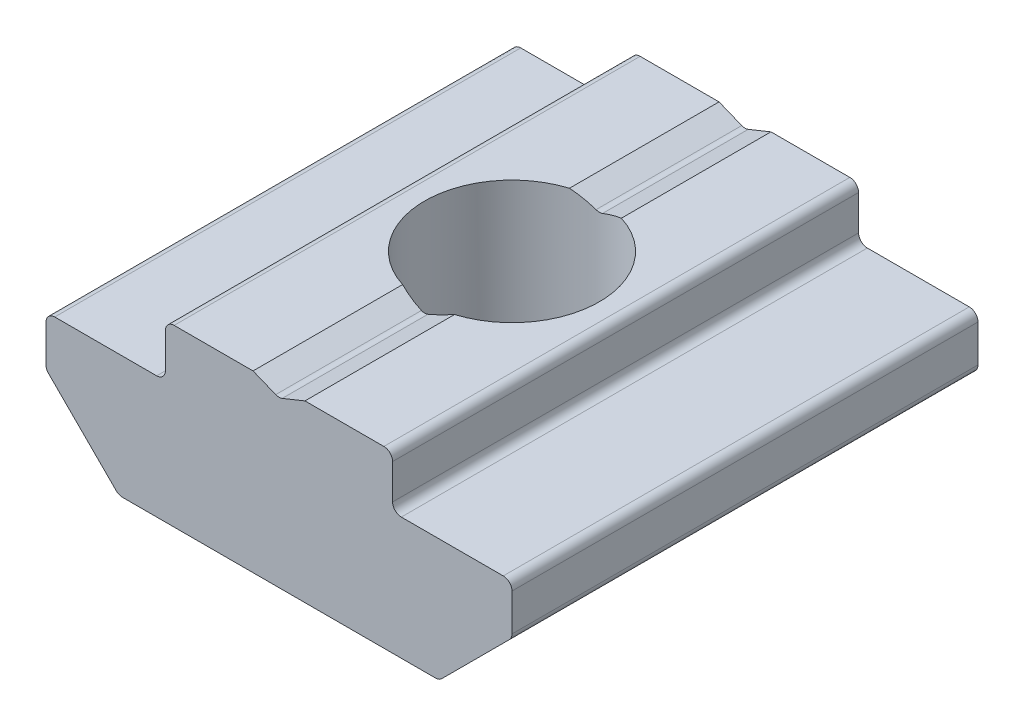
ISO-10303-21;
HEADER;
FILE_DESCRIPTION(('STEP AP214'),'2;1');
FILE_NAME('part.step','',(''),(''),'','','');
FILE_SCHEMA(('AUTOMOTIVE_DESIGN { 1 0 10303 214 1 1 1 1 }'));
ENDSEC;
DATA;
#1=APPLICATION_CONTEXT('core data for automotive mechanical design processes');
#2=APPLICATION_PROTOCOL_DEFINITION('international standard','automotive_design',2000,#1);
#3=PRODUCT_CONTEXT('',#1,'mechanical');
#4=PRODUCT('Part','Part','',(#3));
#5=PRODUCT_RELATED_PRODUCT_CATEGORY('part','',(#4));
#6=PRODUCT_DEFINITION_FORMATION('','',#4);
#7=PRODUCT_DEFINITION_CONTEXT('part definition',#1,'design');
#8=PRODUCT_DEFINITION('design','',#6,#7);
#9=PRODUCT_DEFINITION_SHAPE('','',#8);
#10=(LENGTH_UNIT() NAMED_UNIT(*) SI_UNIT(.MILLI.,.METRE.));
#11=(NAMED_UNIT(*) PLANE_ANGLE_UNIT() SI_UNIT($,.RADIAN.));
#12=(NAMED_UNIT(*) SI_UNIT($,.STERADIAN.) SOLID_ANGLE_UNIT());
#13=UNCERTAINTY_MEASURE_WITH_UNIT(LENGTH_MEASURE(1.E-05),#10,'distance_accuracy_value','');
#14=(GEOMETRIC_REPRESENTATION_CONTEXT(3) GLOBAL_UNCERTAINTY_ASSIGNED_CONTEXT((#13)) GLOBAL_UNIT_ASSIGNED_CONTEXT((#10,
#11,#12)) REPRESENTATION_CONTEXT('',''));
#15=CARTESIAN_POINT('',(0.,0.,0.));
#16=DIRECTION('',(0.,0.,1.));
#17=DIRECTION('',(1.,0.,0.));
#18=AXIS2_PLACEMENT_3D('',#15,#16,#17);
#19=CARTESIAN_POINT('',(0.891031267229868,6.,8.));
#20=DIRECTION('',(0.374606593415911,-0.927183854566788,0.));
#21=DIRECTION('',(0.927183854566788,0.374606593415911,0.));
#22=AXIS2_PLACEMENT_3D('',#19,#20,#21);
#23=PLANE('',#22);
#24=CARTESIAN_POINT('',(0.,5.64,0.));
#25=DIRECTION('',(0.374606593415911,-0.927183854566788,0.));
#26=DIRECTION('',(-0.927183854566788,-0.374606593415911,0.));
#27=AXIS2_PLACEMENT_3D('',#24,#25,#26);
#28=ELLIPSE('',#27,3.23560422803275,3.);
#29=CARTESIAN_POINT('',(0.112381978024774,5.68540526643324,2.9978943095138));
#30=VERTEX_POINT('',#29);
#31=CARTESIAN_POINT('',(0.89103126722987,6.,2.86462271177528));
#32=VERTEX_POINT('',#31);
#33=EDGE_CURVE('E226',#30,#32,#28,.F.);
#34=ORIENTED_EDGE('',*,*,#33,.F.);
#35=DIRECTION('',(0.,0.,-1.));
#36=VECTOR('',#35,1.);
#37=CARTESIAN_POINT('',(0.112381978024774,5.68540526643324,8.));
#38=LINE('',#37,#36);
#39=CARTESIAN_POINT('',(0.112381978024774,5.68540526643324,8.));
#40=VERTEX_POINT('',#39);
#41=EDGE_CURVE('E269',#30,#40,#38,.F.);
#42=ORIENTED_EDGE('',*,*,#41,.T.);
#43=DIRECTION('',(-0.927183854566788,-0.374606593415911,0.));
#44=VECTOR('',#43,1.);
#45=CARTESIAN_POINT('',(0.891031267229868,6.,8.));
#46=LINE('',#45,#44);
#47=CARTESIAN_POINT('',(0.891031267229868,6.,8.));
#48=VERTEX_POINT('',#47);
#49=EDGE_CURVE('E253',#48,#40,#46,.T.);
#50=ORIENTED_EDGE('',*,*,#49,.F.);
#51=DIRECTION('',(0.,0.,-1.));
#52=VECTOR('',#51,1.);
#53=CARTESIAN_POINT('',(0.891031267229868,6.,8.));
#54=LINE('',#53,#52);
#55=EDGE_CURVE('E246',#48,#32,#54,.T.);
#56=ORIENTED_EDGE('',*,*,#55,.T.);
#57=EDGE_LOOP('',(#34,#42,#50,#56));
#58=FACE_BOUND('',#57,.T.);
#59=ADVANCED_FACE('F41',(#58),#23,.F.);
#60=DIRECTION('',(-0.927183854566788,-0.374606593415911,0.));
#61=VECTOR('',#60,1.);
#62=CARTESIAN_POINT('',(0.891031267229868,6.,-8.));
#63=LINE('',#62,#61);
#64=CARTESIAN_POINT('',(0.891031267229868,6.,-8.));
#65=VERTEX_POINT('',#64);
#66=CARTESIAN_POINT('',(0.112381978024774,5.68540526643324,-8.));
#67=VERTEX_POINT('',#66);
#68=EDGE_CURVE('E584',#65,#67,#63,.T.);
#69=ORIENTED_EDGE('',*,*,#68,.T.);
#70=DIRECTION('',(0.,0.,-1.));
#71=VECTOR('',#70,1.);
#72=CARTESIAN_POINT('',(0.112381978024774,5.68540526643324,-3.));
#73=LINE('',#72,#71);
#74=CARTESIAN_POINT('',(0.112381978024774,5.68540526643324,-2.9978943095138));
#75=VERTEX_POINT('',#74);
#76=EDGE_CURVE('E264',#67,#75,#73,.F.);
#77=ORIENTED_EDGE('',*,*,#76,.T.);
#78=CARTESIAN_POINT('',(0.89103126722987,6.,-2.86462271177528));
#79=VERTEX_POINT('',#78);
#80=EDGE_CURVE('E240',#79,#75,#28,.F.);
#81=ORIENTED_EDGE('',*,*,#80,.F.);
#82=EDGE_CURVE('E249',#79,#65,#54,.T.);
#83=ORIENTED_EDGE('',*,*,#82,.T.);
#84=EDGE_LOOP('',(#69,#77,#81,#83));
#85=FACE_BOUND('',#84,.T.);
#86=ADVANCED_FACE('F393',(#85),#23,.F.);
#87=CARTESIAN_POINT('',(0.,5.64,8.));
#88=DIRECTION('',(-0.374606593415912,-0.927183854566787,0.));
#89=DIRECTION('',(0.927183854566787,-0.374606593415912,0.));
#90=AXIS2_PLACEMENT_3D('',#87,#88,#89);
#91=PLANE('',#90);
#92=CARTESIAN_POINT('',(0.,5.64,0.));
#93=DIRECTION('',(-0.374606593415912,-0.927183854566787,0.));
#94=DIRECTION('',(0.927183854566787,-0.374606593415912,0.));
#95=AXIS2_PLACEMENT_3D('',#92,#93,#94);
#96=ELLIPSE('',#95,3.23560422803275,3.);
#97=CARTESIAN_POINT('',(-0.112381978024774,5.68540526643324,-2.9978943095138));
#98=VERTEX_POINT('',#97);
#99=CARTESIAN_POINT('',(-0.891031267229865,6.,-2.86462271177528));
#100=VERTEX_POINT('',#99);
#101=EDGE_CURVE('E237',#98,#100,#96,.F.);
#102=ORIENTED_EDGE('',*,*,#101,.F.);
#103=DIRECTION('',(0.,0.,-1.));
#104=VECTOR('',#103,1.);
#105=CARTESIAN_POINT('',(-0.112381978024773,5.68540526643324,-8.));
#106=LINE('',#105,#104);
#107=CARTESIAN_POINT('',(-0.112381978024773,5.68540526643324,-8.));
#108=VERTEX_POINT('',#107);
#109=EDGE_CURVE('E256',#98,#108,#106,.T.);
#110=ORIENTED_EDGE('',*,*,#109,.T.);
#111=DIRECTION('',(-0.927183854566787,0.374606593415912,0.));
#112=VECTOR('',#111,1.);
#113=CARTESIAN_POINT('',(0.,5.64,-8.));
#114=LINE('',#113,#112);
#115=CARTESIAN_POINT('',(-0.891031267229865,6.,-8.));
#116=VERTEX_POINT('',#115);
#117=EDGE_CURVE('E547',#108,#116,#114,.T.);
#118=ORIENTED_EDGE('',*,*,#117,.T.);
#119=DIRECTION('',(0.,0.,-1.));
#120=VECTOR('',#119,1.);
#121=CARTESIAN_POINT('',(-0.891031267229865,6.,8.));
#122=LINE('',#121,#120);
#123=EDGE_CURVE('E536',#100,#116,#122,.T.);
#124=ORIENTED_EDGE('',*,*,#123,.F.);
#125=EDGE_LOOP('',(#102,#110,#118,#124));
#126=FACE_BOUND('',#125,.T.);
#127=ADVANCED_FACE('F389',(#126),#91,.F.);
#128=DIRECTION('',(-0.927183854566787,0.374606593415912,0.));
#129=VECTOR('',#128,1.);
#130=CARTESIAN_POINT('',(0.,5.64,8.));
#131=LINE('',#130,#129);
#132=CARTESIAN_POINT('',(-0.112381978024773,5.68540526643324,8.));
#133=VERTEX_POINT('',#132);
#134=CARTESIAN_POINT('',(-0.891031267229865,6.,8.));
#135=VERTEX_POINT('',#134);
#136=EDGE_CURVE('E456',#133,#135,#131,.T.);
#137=ORIENTED_EDGE('',*,*,#136,.F.);
#138=DIRECTION('',(0.,0.,-1.));
#139=VECTOR('',#138,1.);
#140=CARTESIAN_POINT('',(-0.112381978024773,5.68540526643324,3.));
#141=LINE('',#140,#139);
#142=CARTESIAN_POINT('',(-0.112381978024773,5.68540526643324,2.9978943095138));
#143=VERTEX_POINT('',#142);
#144=EDGE_CURVE('E266',#133,#143,#141,.T.);
#145=ORIENTED_EDGE('',*,*,#144,.T.);
#146=CARTESIAN_POINT('',(-0.891031267229865,6.,2.86462271177528));
#147=VERTEX_POINT('',#146);
#148=EDGE_CURVE('E238',#147,#143,#96,.F.);
#149=ORIENTED_EDGE('',*,*,#148,.F.);
#150=EDGE_CURVE('E258',#135,#147,#122,.T.);
#151=ORIENTED_EDGE('',*,*,#150,.F.);
#152=EDGE_LOOP('',(#137,#145,#149,#151));
#153=FACE_BOUND('',#152,.T.);
#154=ADVANCED_FACE('F392',(#153),#91,.F.);
#155=CARTESIAN_POINT('',(-3.9,4.2,8.));
#156=DIRECTION('',(0.,-1.,0.));
#157=DIRECTION('',(0.,0.,-1.));
#158=AXIS2_PLACEMENT_3D('',#155,#156,#157);
#159=PLANE('',#158);
#160=DIRECTION('',(-1.,0.,0.));
#161=VECTOR('',#160,1.);
#162=CARTESIAN_POINT('',(-3.9,4.2,8.));
#163=LINE('',#162,#161);
#164=CARTESIAN_POINT('',(-4.2,4.2,8.));
#165=VERTEX_POINT('',#164);
#166=CARTESIAN_POINT('',(-7.7,4.2,8.));
#167=VERTEX_POINT('',#166);
#168=EDGE_CURVE('E435',#165,#167,#163,.T.);
#169=ORIENTED_EDGE('',*,*,#168,.F.);
#170=DIRECTION('',(0.,0.,-1.));
#171=VECTOR('',#170,1.);
#172=CARTESIAN_POINT('',(-4.2,4.2,-8.));
#173=LINE('',#172,#171);
#174=CARTESIAN_POINT('',(-4.2,4.2,-8.));
#175=VERTEX_POINT('',#174);
#176=EDGE_CURVE('E323',#165,#175,#173,.T.);
#177=ORIENTED_EDGE('',*,*,#176,.T.);
#178=DIRECTION('',(-1.,0.,0.));
#179=VECTOR('',#178,1.);
#180=CARTESIAN_POINT('',(-3.9,4.2,-8.));
#181=LINE('',#180,#179);
#182=CARTESIAN_POINT('',(-7.7,4.2,-8.));
#183=VERTEX_POINT('',#182);
#184=EDGE_CURVE('E594',#175,#183,#181,.T.);
#185=ORIENTED_EDGE('',*,*,#184,.T.);
#186=DIRECTION('',(0.,0.,-1.));
#187=VECTOR('',#186,1.);
#188=CARTESIAN_POINT('',(-7.7,4.2,8.));
#189=LINE('',#188,#187);
#190=EDGE_CURVE('E321',#183,#167,#189,.F.);
#191=ORIENTED_EDGE('',*,*,#190,.T.);
#192=EDGE_LOOP('',(#169,#177,#185,#191));
#193=FACE_BOUND('',#192,.T.);
#194=ADVANCED_FACE('F425',(#193),#159,.F.);
#195=CARTESIAN_POINT('',(-8.,4.2,8.));
#196=DIRECTION('',(1.,0.,0.));
#197=DIRECTION('',(0.,0.,-1.));
#198=AXIS2_PLACEMENT_3D('',#195,#196,#197);
#199=PLANE('',#198);
#200=DIRECTION('',(0.,-1.,0.));
#201=VECTOR('',#200,1.);
#202=CARTESIAN_POINT('',(-8.,4.2,8.));
#203=LINE('',#202,#201);
#204=CARTESIAN_POINT('',(-8.,3.9,8.));
#205=VERTEX_POINT('',#204);
#206=CARTESIAN_POINT('',(-8.,2.62426406871193,8.));
#207=VERTEX_POINT('',#206);
#208=EDGE_CURVE('E441',#205,#207,#203,.T.);
#209=ORIENTED_EDGE('',*,*,#208,.F.);
#210=DIRECTION('',(0.,0.,-1.));
#211=VECTOR('',#210,1.);
#212=CARTESIAN_POINT('',(-8.,3.9,8.));
#213=LINE('',#212,#211);
#214=CARTESIAN_POINT('',(-8.,3.9,-8.));
#215=VERTEX_POINT('',#214);
#216=EDGE_CURVE('E328',#205,#215,#213,.T.);
#217=ORIENTED_EDGE('',*,*,#216,.T.);
#218=DIRECTION('',(0.,-1.,0.));
#219=VECTOR('',#218,1.);
#220=CARTESIAN_POINT('',(-8.,4.2,-8.));
#221=LINE('',#220,#219);
#222=CARTESIAN_POINT('',(-8.,2.62426406871193,-8.));
#223=VERTEX_POINT('',#222);
#224=EDGE_CURVE('E598',#215,#223,#221,.T.);
#225=ORIENTED_EDGE('',*,*,#224,.T.);
#226=DIRECTION('',(0.,0.,-1.));
#227=VECTOR('',#226,1.);
#228=CARTESIAN_POINT('',(-8.,2.62426406871193,8.));
#229=LINE('',#228,#227);
#230=EDGE_CURVE('E326',#223,#207,#229,.F.);
#231=ORIENTED_EDGE('',*,*,#230,.T.);
#232=EDGE_LOOP('',(#209,#217,#225,#231));
#233=FACE_BOUND('',#232,.T.);
#234=ADVANCED_FACE('F422',(#233),#199,.F.);
#235=CARTESIAN_POINT('',(-8.,2.5,8.));
#236=DIRECTION('',(0.707106781186549,0.707106781186546,0.));
#237=DIRECTION('',(-0.707106781186546,0.707106781186549,0.));
#238=AXIS2_PLACEMENT_3D('',#235,#236,#237);
#239=PLANE('',#238);
#240=DIRECTION('',(0.707106781186546,-0.707106781186549,0.));
#241=VECTOR('',#240,1.);
#242=CARTESIAN_POINT('',(-8.,2.5,8.));
#243=LINE('',#242,#241);
#244=CARTESIAN_POINT('',(-7.91213203435596,2.41213203435596,8.));
#245=VERTEX_POINT('',#244);
#246=CARTESIAN_POINT('',(-5.58786796564405,0.0878679656440362,8.));
#247=VERTEX_POINT('',#246);
#248=EDGE_CURVE('E553',#245,#247,#243,.T.);
#249=ORIENTED_EDGE('',*,*,#248,.F.);
#250=DIRECTION('',(0.,0.,-1.));
#251=VECTOR('',#250,1.);
#252=CARTESIAN_POINT('',(-7.91213203435596,2.41213203435596,8.));
#253=LINE('',#252,#251);
#254=CARTESIAN_POINT('',(-7.91213203435596,2.41213203435596,-8.));
#255=VERTEX_POINT('',#254);
#256=EDGE_CURVE('E333',#245,#255,#253,.T.);
#257=ORIENTED_EDGE('',*,*,#256,.T.);
#258=DIRECTION('',(0.707106781186546,-0.707106781186549,0.));
#259=VECTOR('',#258,1.);
#260=CARTESIAN_POINT('',(-8.,2.5,-8.));
#261=LINE('',#260,#259);
#262=CARTESIAN_POINT('',(-5.58786796564405,0.0878679656440362,-8.));
#263=VERTEX_POINT('',#262);
#264=EDGE_CURVE('E573',#255,#263,#261,.T.);
#265=ORIENTED_EDGE('',*,*,#264,.T.);
#266=DIRECTION('',(0.,0.,-1.));
#267=VECTOR('',#266,1.);
#268=CARTESIAN_POINT('',(-5.58786796564405,0.0878679656440358,8.));
#269=LINE('',#268,#267);
#270=EDGE_CURVE('E331',#263,#247,#269,.F.);
#271=ORIENTED_EDGE('',*,*,#270,.T.);
#272=EDGE_LOOP('',(#249,#257,#265,#271));
#273=FACE_BOUND('',#272,.T.);
#274=ADVANCED_FACE('F418',(#273),#239,.F.);
#275=CARTESIAN_POINT('',(-5.50000000000001,0.,8.));
#276=DIRECTION('',(0.,1.,0.));
#277=DIRECTION('',(-1.,0.,0.));
#278=AXIS2_PLACEMENT_3D('',#275,#276,#277);
#279=PLANE('',#278);
#280=CARTESIAN_POINT('',(0.,0.,0.));
#281=DIRECTION('',(0.,1.,0.));
#282=DIRECTION('',(0.,0.,1.));
#283=AXIS2_PLACEMENT_3D('',#280,#281,#282);
#284=CIRCLE('',#283,3.);
#285=CARTESIAN_POINT('',(0.,0.,3.));
#286=VERTEX_POINT('',#285);
#287=EDGE_CURVE('E250',#286,#286,#284,.T.);
#288=ORIENTED_EDGE('',*,*,#287,.T.);
#289=EDGE_LOOP('',(#288));
#290=FACE_BOUND('',#289,.T.);
#291=DIRECTION('',(1.,0.,0.));
#292=VECTOR('',#291,1.);
#293=CARTESIAN_POINT('',(-5.50000000000001,0.,8.));
#294=LINE('',#293,#292);
#295=CARTESIAN_POINT('',(-5.37573593128808,0.,8.));
#296=VERTEX_POINT('',#295);
#297=CARTESIAN_POINT('',(5.37573593128808,0.,8.));
#298=VERTEX_POINT('',#297);
#299=EDGE_CURVE('E527',#296,#298,#294,.T.);
#300=ORIENTED_EDGE('',*,*,#299,.F.);
#301=DIRECTION('',(0.,0.,-1.));
#302=VECTOR('',#301,1.);
#303=CARTESIAN_POINT('',(-5.37573593128808,0.,8.));
#304=LINE('',#303,#302);
#305=CARTESIAN_POINT('',(-5.37573593128808,0.,-8.));
#306=VERTEX_POINT('',#305);
#307=EDGE_CURVE('E338',#296,#306,#304,.T.);
#308=ORIENTED_EDGE('',*,*,#307,.T.);
#309=DIRECTION('',(1.,0.,0.));
#310=VECTOR('',#309,1.);
#311=CARTESIAN_POINT('',(-5.50000000000001,0.,-8.));
#312=LINE('',#311,#310);
#313=CARTESIAN_POINT('',(5.37573593128808,0.,-8.));
#314=VERTEX_POINT('',#313);
#315=EDGE_CURVE('E569',#306,#314,#312,.T.);
#316=ORIENTED_EDGE('',*,*,#315,.T.);
#317=DIRECTION('',(0.,0.,-1.));
#318=VECTOR('',#317,1.);
#319=CARTESIAN_POINT('',(5.37573593128808,0.,8.));
#320=LINE('',#319,#318);
#321=EDGE_CURVE('E336',#314,#298,#320,.F.);
#322=ORIENTED_EDGE('',*,*,#321,.T.);
#323=EDGE_LOOP('',(#300,#308,#316,#322));
#324=FACE_BOUND('',#323,.T.);
#325=ADVANCED_FACE('F414',(#290,#324),#279,.F.);
#326=CARTESIAN_POINT('',(8.,2.49999999999998,8.));
#327=DIRECTION('',(-0.707106781186546,0.707106781186549,0.));
#328=DIRECTION('',(-0.707106781186549,-0.707106781186546,0.));
#329=AXIS2_PLACEMENT_3D('',#326,#327,#328);
#330=PLANE('',#329);
#331=DIRECTION('',(0.707106781186549,0.707106781186546,0.));
#332=VECTOR('',#331,1.);
#333=CARTESIAN_POINT('',(8.,2.49999999999998,8.));
#334=LINE('',#333,#332);
#335=CARTESIAN_POINT('',(5.58786796564405,0.0878679656440341,8.));
#336=VERTEX_POINT('',#335);
#337=CARTESIAN_POINT('',(7.91213203435596,2.41213203435594,8.));
#338=VERTEX_POINT('',#337);
#339=EDGE_CURVE('E518',#336,#338,#334,.T.);
#340=ORIENTED_EDGE('',*,*,#339,.F.);
#341=DIRECTION('',(0.,0.,-1.));
#342=VECTOR('',#341,1.);
#343=CARTESIAN_POINT('',(5.58786796564405,0.0878679656440349,8.));
#344=LINE('',#343,#342);
#345=CARTESIAN_POINT('',(5.58786796564405,0.0878679656440341,-8.));
#346=VERTEX_POINT('',#345);
#347=EDGE_CURVE('E343',#336,#346,#344,.T.);
#348=ORIENTED_EDGE('',*,*,#347,.T.);
#349=DIRECTION('',(0.707106781186549,0.707106781186546,0.));
#350=VECTOR('',#349,1.);
#351=CARTESIAN_POINT('',(8.,2.49999999999998,-8.));
#352=LINE('',#351,#350);
#353=CARTESIAN_POINT('',(7.91213203435596,2.41213203435594,-8.));
#354=VERTEX_POINT('',#353);
#355=EDGE_CURVE('E565',#346,#354,#352,.T.);
#356=ORIENTED_EDGE('',*,*,#355,.T.);
#357=DIRECTION('',(0.,0.,-1.));
#358=VECTOR('',#357,1.);
#359=CARTESIAN_POINT('',(7.91213203435596,2.41213203435594,8.));
#360=LINE('',#359,#358);
#361=EDGE_CURVE('E341',#354,#338,#360,.F.);
#362=ORIENTED_EDGE('',*,*,#361,.T.);
#363=EDGE_LOOP('',(#340,#348,#356,#362));
#364=FACE_BOUND('',#363,.T.);
#365=ADVANCED_FACE('F410',(#364),#330,.F.);
#366=CARTESIAN_POINT('',(8.,4.2,8.));
#367=DIRECTION('',(-1.,0.,0.));
#368=DIRECTION('',(0.,0.,1.));
#369=AXIS2_PLACEMENT_3D('',#366,#367,#368);
#370=PLANE('',#369);
#371=DIRECTION('',(0.,1.,0.));
#372=VECTOR('',#371,1.);
#373=CARTESIAN_POINT('',(8.,4.2,8.));
#374=LINE('',#373,#372);
#375=CARTESIAN_POINT('',(8.,2.62426406871191,8.));
#376=VERTEX_POINT('',#375);
#377=CARTESIAN_POINT('',(8.,3.9,8.));
#378=VERTEX_POINT('',#377);
#379=EDGE_CURVE('E515',#376,#378,#374,.T.);
#380=ORIENTED_EDGE('',*,*,#379,.F.);
#381=DIRECTION('',(0.,0.,-1.));
#382=VECTOR('',#381,1.);
#383=CARTESIAN_POINT('',(8.,2.62426406871191,8.));
#384=LINE('',#383,#382);
#385=CARTESIAN_POINT('',(8.,2.62426406871191,-8.));
#386=VERTEX_POINT('',#385);
#387=EDGE_CURVE('E348',#376,#386,#384,.T.);
#388=ORIENTED_EDGE('',*,*,#387,.T.);
#389=DIRECTION('',(0.,1.,0.));
#390=VECTOR('',#389,1.);
#391=CARTESIAN_POINT('',(8.,4.2,-8.));
#392=LINE('',#391,#390);
#393=CARTESIAN_POINT('',(8.,3.9,-8.));
#394=VERTEX_POINT('',#393);
#395=EDGE_CURVE('E568',#386,#394,#392,.T.);
#396=ORIENTED_EDGE('',*,*,#395,.T.);
#397=DIRECTION('',(0.,0.,-1.));
#398=VECTOR('',#397,1.);
#399=CARTESIAN_POINT('',(8.,3.9,8.));
#400=LINE('',#399,#398);
#401=EDGE_CURVE('E346',#394,#378,#400,.F.);
#402=ORIENTED_EDGE('',*,*,#401,.T.);
#403=EDGE_LOOP('',(#380,#388,#396,#402));
#404=FACE_BOUND('',#403,.T.);
#405=ADVANCED_FACE('F406',(#404),#370,.F.);
#406=CARTESIAN_POINT('',(8.,4.2,8.));
#407=DIRECTION('',(0.,-1.,0.));
#408=DIRECTION('',(1.,0.,0.));
#409=AXIS2_PLACEMENT_3D('',#406,#407,#408);
#410=PLANE('',#409);
#411=DIRECTION('',(-1.,0.,0.));
#412=VECTOR('',#411,1.);
#413=CARTESIAN_POINT('',(8.,4.2,-8.));
#414=LINE('',#413,#412);
#415=CARTESIAN_POINT('',(7.7,4.2,-8.));
#416=VERTEX_POINT('',#415);
#417=CARTESIAN_POINT('',(4.2,4.2,-8.));
#418=VERTEX_POINT('',#417);
#419=EDGE_CURVE('E571',#416,#418,#414,.T.);
#420=ORIENTED_EDGE('',*,*,#419,.T.);
#421=DIRECTION('',(0.,0.,-1.));
#422=VECTOR('',#421,1.);
#423=CARTESIAN_POINT('',(4.2,4.2,8.));
#424=LINE('',#423,#422);
#425=CARTESIAN_POINT('',(4.2,4.2,8.));
#426=VERTEX_POINT('',#425);
#427=EDGE_CURVE('E313',#418,#426,#424,.F.);
#428=ORIENTED_EDGE('',*,*,#427,.T.);
#429=DIRECTION('',(-1.,0.,0.));
#430=VECTOR('',#429,1.);
#431=CARTESIAN_POINT('',(8.,4.2,8.));
#432=LINE('',#431,#430);
#433=CARTESIAN_POINT('',(7.7,4.2,8.));
#434=VERTEX_POINT('',#433);
#435=EDGE_CURVE('E522',#434,#426,#432,.T.);
#436=ORIENTED_EDGE('',*,*,#435,.F.);
#437=DIRECTION('',(0.,0.,-1.));
#438=VECTOR('',#437,1.);
#439=CARTESIAN_POINT('',(7.7,4.2,8.));
#440=LINE('',#439,#438);
#441=EDGE_CURVE('E310',#434,#416,#440,.T.);
#442=ORIENTED_EDGE('',*,*,#441,.T.);
#443=EDGE_LOOP('',(#420,#428,#436,#442));
#444=FACE_BOUND('',#443,.T.);
#445=ADVANCED_FACE('F402',(#444),#410,.F.);
#446=CARTESIAN_POINT('',(3.9,6.,8.));
#447=DIRECTION('',(-1.,0.,0.));
#448=DIRECTION('',(0.,-1.,0.));
#449=AXIS2_PLACEMENT_3D('',#446,#447,#448);
#450=PLANE('',#449);
#451=DIRECTION('',(0.,1.,0.));
#452=VECTOR('',#451,1.);
#453=CARTESIAN_POINT('',(3.9,6.,-8.));
#454=LINE('',#453,#452);
#455=CARTESIAN_POINT('',(3.9,4.5,-8.));
#456=VERTEX_POINT('',#455);
#457=CARTESIAN_POINT('',(3.9,5.7,-8.));
#458=VERTEX_POINT('',#457);
#459=EDGE_CURVE('E579',#456,#458,#454,.T.);
#460=ORIENTED_EDGE('',*,*,#459,.T.);
#461=DIRECTION('',(0.,0.,-1.));
#462=VECTOR('',#461,1.);
#463=CARTESIAN_POINT('',(3.9,5.7,8.));
#464=LINE('',#463,#462);
#465=CARTESIAN_POINT('',(3.9,5.7,8.));
#466=VERTEX_POINT('',#465);
#467=EDGE_CURVE('E293',#458,#466,#464,.F.);
#468=ORIENTED_EDGE('',*,*,#467,.T.);
#469=DIRECTION('',(0.,1.,0.));
#470=VECTOR('',#469,1.);
#471=CARTESIAN_POINT('',(3.9,6.,8.));
#472=LINE('',#471,#470);
#473=CARTESIAN_POINT('',(3.9,4.5,8.));
#474=VERTEX_POINT('',#473);
#475=EDGE_CURVE('E525',#474,#466,#472,.T.);
#476=ORIENTED_EDGE('',*,*,#475,.F.);
#477=DIRECTION('',(0.,0.,-1.));
#478=VECTOR('',#477,1.);
#479=CARTESIAN_POINT('',(3.9,4.5,-8.));
#480=LINE('',#479,#478);
#481=EDGE_CURVE('E290',#474,#456,#480,.T.);
#482=ORIENTED_EDGE('',*,*,#481,.T.);
#483=EDGE_LOOP('',(#460,#468,#476,#482));
#484=FACE_BOUND('',#483,.T.);
#485=ADVANCED_FACE('F399',(#484),#450,.F.);
#486=CARTESIAN_POINT('',(0.891031267229868,6.,8.));
#487=DIRECTION('',(0.,-1.,0.));
#488=DIRECTION('',(0.,0.,-1.));
#489=AXIS2_PLACEMENT_3D('',#486,#487,#488);
#490=PLANE('',#489);
#491=DIRECTION('',(-1.,0.,0.));
#492=VECTOR('',#491,1.);
#493=CARTESIAN_POINT('',(0.891031267229868,6.,8.));
#494=LINE('',#493,#492);
#495=CARTESIAN_POINT('',(3.6,6.,8.));
#496=VERTEX_POINT('',#495);
#497=EDGE_CURVE('E532',#496,#48,#494,.T.);
#498=ORIENTED_EDGE('',*,*,#497,.F.);
#499=DIRECTION('',(0.,0.,-1.));
#500=VECTOR('',#499,1.);
#501=CARTESIAN_POINT('',(3.6,6.,8.));
#502=LINE('',#501,#500);
#503=CARTESIAN_POINT('',(3.6,6.,-8.));
#504=VERTEX_POINT('',#503);
#505=EDGE_CURVE('E271',#496,#504,#502,.T.);
#506=ORIENTED_EDGE('',*,*,#505,.T.);
#507=DIRECTION('',(-1.,0.,0.));
#508=VECTOR('',#507,1.);
#509=CARTESIAN_POINT('',(0.891031267229868,6.,-8.));
#510=LINE('',#509,#508);
#511=EDGE_CURVE('E582',#504,#65,#510,.T.);
#512=ORIENTED_EDGE('',*,*,#511,.T.);
#513=ORIENTED_EDGE('',*,*,#82,.F.);
#514=CARTESIAN_POINT('',(0.,6.,0.));
#515=DIRECTION('',(0.,1.,0.));
#516=DIRECTION('',(0.,0.,1.));
#517=AXIS2_PLACEMENT_3D('',#514,#515,#516);
#518=CIRCLE('',#517,3.);
#519=EDGE_CURVE('E230',#32,#79,#518,.T.);
#520=ORIENTED_EDGE('',*,*,#519,.F.);
#521=ORIENTED_EDGE('',*,*,#55,.F.);
#522=EDGE_LOOP('',(#498,#506,#512,#513,#520,#521));
#523=FACE_BOUND('',#522,.T.);
#524=ADVANCED_FACE('F245',(#523),#490,.F.);
#525=CARTESIAN_POINT('',(-3.9,6.,8.));
#526=DIRECTION('',(0.,-1.,0.));
#527=DIRECTION('',(1.,0.,0.));
#528=AXIS2_PLACEMENT_3D('',#525,#526,#527);
#529=PLANE('',#528);
#530=DIRECTION('',(-1.,0.,0.));
#531=VECTOR('',#530,1.);
#532=CARTESIAN_POINT('',(-3.9,6.,-8.));
#533=LINE('',#532,#531);
#534=CARTESIAN_POINT('',(-3.6,6.,-8.));
#535=VERTEX_POINT('',#534);
#536=EDGE_CURVE('E545',#116,#535,#533,.T.);
#537=ORIENTED_EDGE('',*,*,#536,.T.);
#538=DIRECTION('',(0.,0.,-1.));
#539=VECTOR('',#538,1.);
#540=CARTESIAN_POINT('',(-3.6,6.,8.));
#541=LINE('',#540,#539);
#542=CARTESIAN_POINT('',(-3.6,6.,8.));
#543=VERTEX_POINT('',#542);
#544=EDGE_CURVE('E319',#535,#543,#541,.F.);
#545=ORIENTED_EDGE('',*,*,#544,.T.);
#546=DIRECTION('',(-1.,0.,0.));
#547=VECTOR('',#546,1.);
#548=CARTESIAN_POINT('',(-3.9,6.,8.));
#549=LINE('',#548,#547);
#550=EDGE_CURVE('E463',#135,#543,#549,.T.);
#551=ORIENTED_EDGE('',*,*,#550,.F.);
#552=ORIENTED_EDGE('',*,*,#150,.T.);
#553=CARTESIAN_POINT('',(0.,6.,0.));
#554=DIRECTION('',(0.,-1.,0.));
#555=DIRECTION('',(1.,0.,0.));
#556=AXIS2_PLACEMENT_3D('',#553,#554,#555);
#557=CIRCLE('',#556,3.);
#558=EDGE_CURVE('E254',#100,#147,#557,.F.);
#559=ORIENTED_EDGE('',*,*,#558,.F.);
#560=ORIENTED_EDGE('',*,*,#123,.T.);
#561=EDGE_LOOP('',(#537,#545,#551,#552,#559,#560));
#562=FACE_BOUND('',#561,.T.);
#563=ADVANCED_FACE('F385',(#562),#529,.F.);
#564=CARTESIAN_POINT('',(-3.9,4.2,8.));
#565=DIRECTION('',(1.,0.,0.));
#566=DIRECTION('',(0.,0.,-1.));
#567=AXIS2_PLACEMENT_3D('',#564,#565,#566);
#568=PLANE('',#567);
#569=DIRECTION('',(0.,-1.,0.));
#570=VECTOR('',#569,1.);
#571=CARTESIAN_POINT('',(-3.9,4.2,8.));
#572=LINE('',#571,#570);
#573=CARTESIAN_POINT('',(-3.9,5.7,8.));
#574=VERTEX_POINT('',#573);
#575=CARTESIAN_POINT('',(-3.9,4.5,8.));
#576=VERTEX_POINT('',#575);
#577=EDGE_CURVE('E535',#574,#576,#572,.T.);
#578=ORIENTED_EDGE('',*,*,#577,.F.);
#579=DIRECTION('',(0.,0.,-1.));
#580=VECTOR('',#579,1.);
#581=CARTESIAN_POINT('',(-3.9,5.7,8.));
#582=LINE('',#581,#580);
#583=CARTESIAN_POINT('',(-3.9,5.7,-8.));
#584=VERTEX_POINT('',#583);
#585=EDGE_CURVE('E316',#574,#584,#582,.T.);
#586=ORIENTED_EDGE('',*,*,#585,.T.);
#587=DIRECTION('',(0.,-1.,0.));
#588=VECTOR('',#587,1.);
#589=CARTESIAN_POINT('',(-3.9,4.2,-8.));
#590=LINE('',#589,#588);
#591=CARTESIAN_POINT('',(-3.9,4.5,-8.));
#592=VERTEX_POINT('',#591);
#593=EDGE_CURVE('E442',#584,#592,#590,.T.);
#594=ORIENTED_EDGE('',*,*,#593,.T.);
#595=DIRECTION('',(0.,0.,-1.));
#596=VECTOR('',#595,1.);
#597=CARTESIAN_POINT('',(-3.9,4.5,8.));
#598=LINE('',#597,#596);
#599=EDGE_CURVE('E56',#592,#576,#598,.F.);
#600=ORIENTED_EDGE('',*,*,#599,.T.);
#601=EDGE_LOOP('',(#578,#586,#594,#600));
#602=FACE_BOUND('',#601,.T.);
#603=ADVANCED_FACE('F382',(#602),#568,.F.);
#604=CARTESIAN_POINT('',(0.,0.,8.));
#605=DIRECTION('',(0.,0.,1.));
#606=DIRECTION('',(1.,0.,0.));
#607=AXIS2_PLACEMENT_3D('',#604,#605,#606);
#608=PLANE('',#607);
#609=ORIENTED_EDGE('',*,*,#475,.T.);
#610=CARTESIAN_POINT('',(3.6,5.7,8.));
#611=DIRECTION('',(0.,0.,1.));
#612=DIRECTION('',(1.,0.,0.));
#613=AXIS2_PLACEMENT_3D('',#610,#611,#612);
#614=CIRCLE('',#613,0.3);
#615=EDGE_CURVE('E308',#466,#496,#614,.T.);
#616=ORIENTED_EDGE('',*,*,#615,.T.);
#617=ORIENTED_EDGE('',*,*,#497,.T.);
#618=ORIENTED_EDGE('',*,*,#49,.T.);
#619=CARTESIAN_POINT('',(0.,5.96356042280328,8.));
#620=DIRECTION('',(0.,0.,1.));
#621=DIRECTION('',(1.,0.,0.));
#622=AXIS2_PLACEMENT_3D('',#619,#620,#621);
#623=CIRCLE('',#622,0.3);
#624=EDGE_CURVE('E452',#40,#133,#623,.F.);
#625=ORIENTED_EDGE('',*,*,#624,.T.);
#626=ORIENTED_EDGE('',*,*,#136,.T.);
#627=ORIENTED_EDGE('',*,*,#550,.T.);
#628=CARTESIAN_POINT('',(-3.6,5.7,8.));
#629=DIRECTION('',(0.,0.,1.));
#630=DIRECTION('',(1.,0.,0.));
#631=AXIS2_PLACEMENT_3D('',#628,#629,#630);
#632=CIRCLE('',#631,0.3);
#633=EDGE_CURVE('E63',#543,#574,#632,.T.);
#634=ORIENTED_EDGE('',*,*,#633,.T.);
#635=ORIENTED_EDGE('',*,*,#577,.T.);
#636=CARTESIAN_POINT('',(-4.2,4.5,8.));
#637=DIRECTION('',(0.,0.,1.));
#638=DIRECTION('',(1.,0.,0.));
#639=AXIS2_PLACEMENT_3D('',#636,#637,#638);
#640=CIRCLE('',#639,0.3);
#641=EDGE_CURVE('E11',#576,#165,#640,.F.);
#642=ORIENTED_EDGE('',*,*,#641,.T.);
#643=ORIENTED_EDGE('',*,*,#168,.T.);
#644=CARTESIAN_POINT('',(-7.7,3.9,8.));
#645=DIRECTION('',(0.,0.,1.));
#646=DIRECTION('',(1.,0.,0.));
#647=AXIS2_PLACEMENT_3D('',#644,#645,#646);
#648=CIRCLE('',#647,0.3);
#649=EDGE_CURVE('E305',#167,#205,#648,.T.);
#650=ORIENTED_EDGE('',*,*,#649,.T.);
#651=ORIENTED_EDGE('',*,*,#208,.T.);
#652=CARTESIAN_POINT('',(-7.7,2.62426406871193,8.));
#653=DIRECTION('',(0.,0.,1.));
#654=DIRECTION('',(1.,0.,0.));
#655=AXIS2_PLACEMENT_3D('',#652,#653,#654);
#656=CIRCLE('',#655,0.3);
#657=EDGE_CURVE('E303',#207,#245,#656,.T.);
#658=ORIENTED_EDGE('',*,*,#657,.T.);
#659=ORIENTED_EDGE('',*,*,#248,.T.);
#660=CARTESIAN_POINT('',(-5.37573593128808,0.3,8.));
#661=DIRECTION('',(0.,0.,1.));
#662=DIRECTION('',(1.,0.,0.));
#663=AXIS2_PLACEMENT_3D('',#660,#661,#662);
#664=CIRCLE('',#663,0.3);
#665=EDGE_CURVE('E301',#247,#296,#664,.T.);
#666=ORIENTED_EDGE('',*,*,#665,.T.);
#667=ORIENTED_EDGE('',*,*,#299,.T.);
#668=CARTESIAN_POINT('',(5.37573593128808,0.3,8.));
#669=DIRECTION('',(0.,0.,1.));
#670=DIRECTION('',(1.,0.,0.));
#671=AXIS2_PLACEMENT_3D('',#668,#669,#670);
#672=CIRCLE('',#671,0.3);
#673=EDGE_CURVE('E299',#298,#336,#672,.T.);
#674=ORIENTED_EDGE('',*,*,#673,.T.);
#675=ORIENTED_EDGE('',*,*,#339,.T.);
#676=CARTESIAN_POINT('',(7.7,2.62426406871191,8.));
#677=DIRECTION('',(0.,0.,1.));
#678=DIRECTION('',(1.,0.,0.));
#679=AXIS2_PLACEMENT_3D('',#676,#677,#678);
#680=CIRCLE('',#679,0.3);
#681=EDGE_CURVE('E297',#338,#376,#680,.T.);
#682=ORIENTED_EDGE('',*,*,#681,.T.);
#683=ORIENTED_EDGE('',*,*,#379,.T.);
#684=CARTESIAN_POINT('',(7.7,3.9,8.));
#685=DIRECTION('',(0.,0.,1.));
#686=DIRECTION('',(1.,0.,0.));
#687=AXIS2_PLACEMENT_3D('',#684,#685,#686);
#688=CIRCLE('',#687,0.3);
#689=EDGE_CURVE('E295',#378,#434,#688,.T.);
#690=ORIENTED_EDGE('',*,*,#689,.T.);
#691=ORIENTED_EDGE('',*,*,#435,.T.);
#692=CARTESIAN_POINT('',(4.2,4.5,8.));
#693=DIRECTION('',(0.,0.,1.));
#694=DIRECTION('',(1.,0.,0.));
#695=AXIS2_PLACEMENT_3D('',#692,#693,#694);
#696=CIRCLE('',#695,0.3);
#697=EDGE_CURVE('E448',#426,#474,#696,.F.);
#698=ORIENTED_EDGE('',*,*,#697,.T.);
#699=EDGE_LOOP('',(#609,#616,#617,#618,#625,#626,#627,#634,#635,#642,#643,#650,#651,#658,#659,
#666,#667,#674,#675,#682,#683,#690,#691,#698));
#700=FACE_BOUND('',#699,.T.);
#701=ADVANCED_FACE('F378',(#700),#608,.T.);
#702=CARTESIAN_POINT('',(0.,0.,-8.));
#703=DIRECTION('',(0.,0.,1.));
#704=DIRECTION('',(1.,0.,0.));
#705=AXIS2_PLACEMENT_3D('',#702,#703,#704);
#706=PLANE('',#705);
#707=ORIENTED_EDGE('',*,*,#511,.F.);
#708=CARTESIAN_POINT('',(3.6,5.7,-8.));
#709=DIRECTION('',(0.,0.,1.));
#710=DIRECTION('',(1.,0.,0.));
#711=AXIS2_PLACEMENT_3D('',#708,#709,#710);
#712=CIRCLE('',#711,0.3);
#713=EDGE_CURVE('E288',#504,#458,#712,.F.);
#714=ORIENTED_EDGE('',*,*,#713,.T.);
#715=ORIENTED_EDGE('',*,*,#459,.F.);
#716=CARTESIAN_POINT('',(4.2,4.5,-8.));
#717=DIRECTION('',(0.,0.,1.));
#718=DIRECTION('',(1.,0.,0.));
#719=AXIS2_PLACEMENT_3D('',#716,#717,#718);
#720=CIRCLE('',#719,0.3);
#721=EDGE_CURVE('E449',#456,#418,#720,.T.);
#722=ORIENTED_EDGE('',*,*,#721,.T.);
#723=ORIENTED_EDGE('',*,*,#419,.F.);
#724=CARTESIAN_POINT('',(7.7,3.9,-8.));
#725=DIRECTION('',(0.,0.,1.));
#726=DIRECTION('',(1.,0.,0.));
#727=AXIS2_PLACEMENT_3D('',#724,#725,#726);
#728=CIRCLE('',#727,0.3);
#729=EDGE_CURVE('E274',#416,#394,#728,.F.);
#730=ORIENTED_EDGE('',*,*,#729,.T.);
#731=ORIENTED_EDGE('',*,*,#395,.F.);
#732=CARTESIAN_POINT('',(7.7,2.62426406871191,-8.));
#733=DIRECTION('',(0.,0.,1.));
#734=DIRECTION('',(1.,0.,0.));
#735=AXIS2_PLACEMENT_3D('',#732,#733,#734);
#736=CIRCLE('',#735,0.3);
#737=EDGE_CURVE('E276',#386,#354,#736,.F.);
#738=ORIENTED_EDGE('',*,*,#737,.T.);
#739=ORIENTED_EDGE('',*,*,#355,.F.);
#740=CARTESIAN_POINT('',(5.37573593128808,0.3,-8.));
#741=DIRECTION('',(0.,0.,1.));
#742=DIRECTION('',(1.,0.,0.));
#743=AXIS2_PLACEMENT_3D('',#740,#741,#742);
#744=CIRCLE('',#743,0.3);
#745=EDGE_CURVE('E278',#346,#314,#744,.F.);
#746=ORIENTED_EDGE('',*,*,#745,.T.);
#747=ORIENTED_EDGE('',*,*,#315,.F.);
#748=CARTESIAN_POINT('',(-5.37573593128808,0.3,-8.));
#749=DIRECTION('',(0.,0.,1.));
#750=DIRECTION('',(1.,0.,0.));
#751=AXIS2_PLACEMENT_3D('',#748,#749,#750);
#752=CIRCLE('',#751,0.3);
#753=EDGE_CURVE('E280',#306,#263,#752,.F.);
#754=ORIENTED_EDGE('',*,*,#753,.T.);
#755=ORIENTED_EDGE('',*,*,#264,.F.);
#756=CARTESIAN_POINT('',(-7.7,2.62426406871193,-8.));
#757=DIRECTION('',(0.,0.,1.));
#758=DIRECTION('',(1.,0.,0.));
#759=AXIS2_PLACEMENT_3D('',#756,#757,#758);
#760=CIRCLE('',#759,0.3);
#761=EDGE_CURVE('E282',#255,#223,#760,.F.);
#762=ORIENTED_EDGE('',*,*,#761,.T.);
#763=ORIENTED_EDGE('',*,*,#224,.F.);
#764=CARTESIAN_POINT('',(-7.7,3.9,-8.));
#765=DIRECTION('',(0.,0.,1.));
#766=DIRECTION('',(1.,0.,0.));
#767=AXIS2_PLACEMENT_3D('',#764,#765,#766);
#768=CIRCLE('',#767,0.3);
#769=EDGE_CURVE('E284',#215,#183,#768,.F.);
#770=ORIENTED_EDGE('',*,*,#769,.T.);
#771=ORIENTED_EDGE('',*,*,#184,.F.);
#772=CARTESIAN_POINT('',(-4.2,4.5,-8.));
#773=DIRECTION('',(0.,0.,1.));
#774=DIRECTION('',(1.,0.,0.));
#775=AXIS2_PLACEMENT_3D('',#772,#773,#774);
#776=CIRCLE('',#775,0.3);
#777=EDGE_CURVE('E49',#175,#592,#776,.T.);
#778=ORIENTED_EDGE('',*,*,#777,.T.);
#779=ORIENTED_EDGE('',*,*,#593,.F.);
#780=CARTESIAN_POINT('',(-3.6,5.7,-8.));
#781=DIRECTION('',(0.,0.,1.));
#782=DIRECTION('',(1.,0.,0.));
#783=AXIS2_PLACEMENT_3D('',#780,#781,#782);
#784=CIRCLE('',#783,0.3);
#785=EDGE_CURVE('E286',#584,#535,#784,.F.);
#786=ORIENTED_EDGE('',*,*,#785,.T.);
#787=ORIENTED_EDGE('',*,*,#536,.F.);
#788=ORIENTED_EDGE('',*,*,#117,.F.);
#789=CARTESIAN_POINT('',(0.,5.96356042280328,-8.));
#790=DIRECTION('',(0.,0.,1.));
#791=DIRECTION('',(1.,0.,0.));
#792=AXIS2_PLACEMENT_3D('',#789,#790,#791);
#793=CIRCLE('',#792,0.3);
#794=EDGE_CURVE('E351',#108,#67,#793,.T.);
#795=ORIENTED_EDGE('',*,*,#794,.T.);
#796=ORIENTED_EDGE('',*,*,#68,.F.);
#797=EDGE_LOOP('',(#707,#714,#715,#722,#723,#730,#731,#738,#739,#746,#747,#754,#755,#762,#763,
#770,#771,#778,#779,#786,#787,#788,#795,#796));
#798=FACE_BOUND('',#797,.T.);
#799=ADVANCED_FACE('F373',(#798),#706,.F.);
#800=CARTESIAN_POINT('',(0.,6.,0.));
#801=DIRECTION('',(0.,-1.,0.));
#802=DIRECTION('',(0.,0.,-1.));
#803=AXIS2_PLACEMENT_3D('',#800,#801,#802);
#804=CYLINDRICAL_SURFACE('',#803,3.);
#805=ORIENTED_EDGE('',*,*,#287,.F.);
#806=EDGE_LOOP('',(#805));
#807=FACE_BOUND('',#806,.T.);
#808=ORIENTED_EDGE('',*,*,#80,.T.);
#809=CARTESIAN_POINT('',(0.112381978024774,5.68540526643324,-2.9978943095138));
#810=CARTESIAN_POINT('',(0.096823835611264,5.67910322228633,-2.9984828951514));
#811=CARTESIAN_POINT('',(0.0807262722161657,5.67413391970066,-2.99896002643732));
#812=CARTESIAN_POINT('',(0.0479092234405914,5.66693837391985,-2.99966088991675));
#813=CARTESIAN_POINT('',(0.0311892270284396,5.66471443828833,-2.99988440892875));
#814=CARTESIAN_POINT('',(-0.00240054184332994,5.66309746112783,-3.00004652531337));
#815=CARTESIAN_POINT('',(-0.0192704164940758,5.66370652730712,-2.99998491055117));
#816=CARTESIAN_POINT('',(-0.0526338687848879,5.66773841783141,-2.99958422261358));
#817=CARTESIAN_POINT('',(-0.0691281942554825,5.67115503378337,-2.99924576164155));
#818=CARTESIAN_POINT('',(-0.0944178446525533,5.6786421112156,-2.99852846880628));
#819=CARTESIAN_POINT('',(-0.103490324928034,5.68180879861828,-2.99822873726271));
#820=CARTESIAN_POINT('',(-0.112381978024773,5.68540526643324,-2.9978943095138));
#821=B_SPLINE_CURVE_WITH_KNOTS('',3,(#809,#810,#811,#812,#813,#814,#815,#816,#817,#818,#819,
#820),.UNSPECIFIED.,.F.,.F.,(4,2,2,2,2,4),(0.,0.0503245364697127,0.100691343490033,
0.151095628604403,0.201388752673647,0.230183715919204),.UNSPECIFIED.);
#822=EDGE_CURVE('E353',#75,#98,#821,.T.);
#823=ORIENTED_EDGE('',*,*,#822,.T.);
#824=ORIENTED_EDGE('',*,*,#101,.T.);
#825=ORIENTED_EDGE('',*,*,#558,.T.);
#826=ORIENTED_EDGE('',*,*,#148,.T.);
#827=CARTESIAN_POINT('',(-0.112381978024773,5.68540526643324,2.9978943095138));
#828=CARTESIAN_POINT('',(-0.0968238356112633,5.67910322228633,2.9984828951514));
#829=CARTESIAN_POINT('',(-0.080726272216165,5.67413391970066,2.99896002643732));
#830=CARTESIAN_POINT('',(-0.0479092234405906,5.66693837391985,2.99966088991675));
#831=CARTESIAN_POINT('',(-0.0311892270284388,5.66471443828833,2.99988440892875));
#832=CARTESIAN_POINT('',(0.00240054184333081,5.66309746112783,3.00004652531337));
#833=CARTESIAN_POINT('',(0.0192704164940767,5.66370652730712,2.99998491055117));
#834=CARTESIAN_POINT('',(0.0526338687848889,5.66773841783141,2.99958422261358));
#835=CARTESIAN_POINT('',(0.0691281942554835,5.67115503378337,2.99924576164155));
#836=CARTESIAN_POINT('',(0.0944178446525542,5.6786421112156,2.99852846880628));
#837=CARTESIAN_POINT('',(0.103490324928035,5.68180879861828,2.99822873726271));
#838=CARTESIAN_POINT('',(0.112381978024774,5.68540526643324,2.9978943095138));
#839=B_SPLINE_CURVE_WITH_KNOTS('',3,(#827,#828,#829,#830,#831,#832,#833,#834,#835,#836,#837,
#838),.UNSPECIFIED.,.F.,.F.,(4,2,2,2,2,4),(0.,0.0503245364697128,0.100691343490033,
0.151095628604404,0.201388752673647,0.230183715919204),.UNSPECIFIED.);
#840=EDGE_CURVE('E233',#143,#30,#839,.T.);
#841=ORIENTED_EDGE('',*,*,#840,.T.);
#842=ORIENTED_EDGE('',*,*,#33,.T.);
#843=ORIENTED_EDGE('',*,*,#519,.T.);
#844=EDGE_LOOP('',(#808,#823,#824,#825,#826,#841,#842,#843));
#845=FACE_BOUND('',#844,.T.);
#846=ADVANCED_FACE('F229',(#807,#845),#804,.F.);
#847=CARTESIAN_POINT('',(0.,5.96356042280328,8.));
#848=DIRECTION('',(0.,0.,1.));
#849=DIRECTION('',(1.,0.,0.));
#850=AXIS2_PLACEMENT_3D('',#847,#848,#849);
#851=CYLINDRICAL_SURFACE('',#850,0.3);
#852=ORIENTED_EDGE('',*,*,#822,.F.);
#853=ORIENTED_EDGE('',*,*,#76,.F.);
#854=ORIENTED_EDGE('',*,*,#794,.F.);
#855=ORIENTED_EDGE('',*,*,#109,.F.);
#856=EDGE_LOOP('',(#852,#853,#854,#855));
#857=FACE_BOUND('',#856,.T.);
#858=ADVANCED_FACE('F367',(#857),#851,.F.);
#859=CARTESIAN_POINT('',(0.,5.96356042280328,8.));
#860=DIRECTION('',(0.,0.,1.));
#861=DIRECTION('',(1.,0.,0.));
#862=AXIS2_PLACEMENT_3D('',#859,#860,#861);
#863=CYLINDRICAL_SURFACE('',#862,0.3);
#864=ORIENTED_EDGE('',*,*,#624,.F.);
#865=ORIENTED_EDGE('',*,*,#41,.F.);
#866=ORIENTED_EDGE('',*,*,#840,.F.);
#867=ORIENTED_EDGE('',*,*,#144,.F.);
#868=EDGE_LOOP('',(#864,#865,#866,#867));
#869=FACE_BOUND('',#868,.T.);
#870=ADVANCED_FACE('F465',(#869),#863,.F.);
#871=CARTESIAN_POINT('',(3.6,5.7,8.));
#872=DIRECTION('',(0.,0.,-1.));
#873=DIRECTION('',(-1.,0.,0.));
#874=AXIS2_PLACEMENT_3D('',#871,#872,#873);
#875=CYLINDRICAL_SURFACE('',#874,0.3);
#876=ORIENTED_EDGE('',*,*,#615,.F.);
#877=ORIENTED_EDGE('',*,*,#467,.F.);
#878=ORIENTED_EDGE('',*,*,#713,.F.);
#879=ORIENTED_EDGE('',*,*,#505,.F.);
#880=EDGE_LOOP('',(#876,#877,#878,#879));
#881=FACE_BOUND('',#880,.T.);
#882=ADVANCED_FACE('F467',(#881),#875,.T.);
#883=CARTESIAN_POINT('',(4.2,4.5,8.));
#884=DIRECTION('',(0.,0.,1.));
#885=DIRECTION('',(1.,0.,0.));
#886=AXIS2_PLACEMENT_3D('',#883,#884,#885);
#887=CYLINDRICAL_SURFACE('',#886,0.3);
#888=ORIENTED_EDGE('',*,*,#697,.F.);
#889=ORIENTED_EDGE('',*,*,#427,.F.);
#890=ORIENTED_EDGE('',*,*,#721,.F.);
#891=ORIENTED_EDGE('',*,*,#481,.F.);
#892=EDGE_LOOP('',(#888,#889,#890,#891));
#893=FACE_BOUND('',#892,.T.);
#894=ADVANCED_FACE('F472',(#893),#887,.F.);
#895=CARTESIAN_POINT('',(-3.6,5.7,8.));
#896=DIRECTION('',(0.,0.,-1.));
#897=DIRECTION('',(-1.,0.,0.));
#898=AXIS2_PLACEMENT_3D('',#895,#896,#897);
#899=CYLINDRICAL_SURFACE('',#898,0.3);
#900=ORIENTED_EDGE('',*,*,#633,.F.);
#901=ORIENTED_EDGE('',*,*,#544,.F.);
#902=ORIENTED_EDGE('',*,*,#785,.F.);
#903=ORIENTED_EDGE('',*,*,#585,.F.);
#904=EDGE_LOOP('',(#900,#901,#902,#903));
#905=FACE_BOUND('',#904,.T.);
#906=ADVANCED_FACE('F480',(#905),#899,.T.);
#907=CARTESIAN_POINT('',(-4.2,4.5,8.));
#908=DIRECTION('',(0.,0.,1.));
#909=DIRECTION('',(1.,0.,0.));
#910=AXIS2_PLACEMENT_3D('',#907,#908,#909);
#911=CYLINDRICAL_SURFACE('',#910,0.3);
#912=ORIENTED_EDGE('',*,*,#641,.F.);
#913=ORIENTED_EDGE('',*,*,#599,.F.);
#914=ORIENTED_EDGE('',*,*,#777,.F.);
#915=ORIENTED_EDGE('',*,*,#176,.F.);
#916=EDGE_LOOP('',(#912,#913,#914,#915));
#917=FACE_BOUND('',#916,.T.);
#918=ADVANCED_FACE('F446',(#917),#911,.F.);
#919=CARTESIAN_POINT('',(-7.7,3.9,8.));
#920=DIRECTION('',(0.,0.,-1.));
#921=DIRECTION('',(-1.,0.,0.));
#922=AXIS2_PLACEMENT_3D('',#919,#920,#921);
#923=CYLINDRICAL_SURFACE('',#922,0.3);
#924=ORIENTED_EDGE('',*,*,#649,.F.);
#925=ORIENTED_EDGE('',*,*,#190,.F.);
#926=ORIENTED_EDGE('',*,*,#769,.F.);
#927=ORIENTED_EDGE('',*,*,#216,.F.);
#928=EDGE_LOOP('',(#924,#925,#926,#927));
#929=FACE_BOUND('',#928,.T.);
#930=ADVANCED_FACE('F487',(#929),#923,.T.);
#931=CARTESIAN_POINT('',(-7.7,2.62426406871193,8.));
#932=DIRECTION('',(0.,0.,-1.));
#933=DIRECTION('',(-1.,0.,0.));
#934=AXIS2_PLACEMENT_3D('',#931,#932,#933);
#935=CYLINDRICAL_SURFACE('',#934,0.3);
#936=ORIENTED_EDGE('',*,*,#657,.F.);
#937=ORIENTED_EDGE('',*,*,#230,.F.);
#938=ORIENTED_EDGE('',*,*,#761,.F.);
#939=ORIENTED_EDGE('',*,*,#256,.F.);
#940=EDGE_LOOP('',(#936,#937,#938,#939));
#941=FACE_BOUND('',#940,.T.);
#942=ADVANCED_FACE('F490',(#941),#935,.T.);
#943=CARTESIAN_POINT('',(-5.37573593128808,0.3,8.));
#944=DIRECTION('',(0.,0.,-1.));
#945=DIRECTION('',(-1.,0.,0.));
#946=AXIS2_PLACEMENT_3D('',#943,#944,#945);
#947=CYLINDRICAL_SURFACE('',#946,0.3);
#948=ORIENTED_EDGE('',*,*,#665,.F.);
#949=ORIENTED_EDGE('',*,*,#270,.F.);
#950=ORIENTED_EDGE('',*,*,#753,.F.);
#951=ORIENTED_EDGE('',*,*,#307,.F.);
#952=EDGE_LOOP('',(#948,#949,#950,#951));
#953=FACE_BOUND('',#952,.T.);
#954=ADVANCED_FACE('F494',(#953),#947,.T.);
#955=CARTESIAN_POINT('',(5.37573593128808,0.3,8.));
#956=DIRECTION('',(0.,0.,-1.));
#957=DIRECTION('',(-1.,0.,0.));
#958=AXIS2_PLACEMENT_3D('',#955,#956,#957);
#959=CYLINDRICAL_SURFACE('',#958,0.3);
#960=ORIENTED_EDGE('',*,*,#673,.F.);
#961=ORIENTED_EDGE('',*,*,#321,.F.);
#962=ORIENTED_EDGE('',*,*,#745,.F.);
#963=ORIENTED_EDGE('',*,*,#347,.F.);
#964=EDGE_LOOP('',(#960,#961,#962,#963));
#965=FACE_BOUND('',#964,.T.);
#966=ADVANCED_FACE('F498',(#965),#959,.T.);
#967=CARTESIAN_POINT('',(7.7,2.62426406871191,8.));
#968=DIRECTION('',(0.,0.,-1.));
#969=DIRECTION('',(-1.,0.,0.));
#970=AXIS2_PLACEMENT_3D('',#967,#968,#969);
#971=CYLINDRICAL_SURFACE('',#970,0.3);
#972=ORIENTED_EDGE('',*,*,#681,.F.);
#973=ORIENTED_EDGE('',*,*,#361,.F.);
#974=ORIENTED_EDGE('',*,*,#737,.F.);
#975=ORIENTED_EDGE('',*,*,#387,.F.);
#976=EDGE_LOOP('',(#972,#973,#974,#975));
#977=FACE_BOUND('',#976,.T.);
#978=ADVANCED_FACE('F501',(#977),#971,.T.);
#979=CARTESIAN_POINT('',(7.7,3.9,8.));
#980=DIRECTION('',(0.,0.,-1.));
#981=DIRECTION('',(-1.,0.,0.));
#982=AXIS2_PLACEMENT_3D('',#979,#980,#981);
#983=CYLINDRICAL_SURFACE('',#982,0.3);
#984=ORIENTED_EDGE('',*,*,#689,.F.);
#985=ORIENTED_EDGE('',*,*,#401,.F.);
#986=ORIENTED_EDGE('',*,*,#729,.F.);
#987=ORIENTED_EDGE('',*,*,#441,.F.);
#988=EDGE_LOOP('',(#984,#985,#986,#987));
#989=FACE_BOUND('',#988,.T.);
#990=ADVANCED_FACE('F43',(#989),#983,.T.);
#991=CLOSED_SHELL('',(#59,#86,#127,#154,#194,#234,#274,#325,#365,#405,#445,#485,#524,#563,#603,
#701,#799,#846,#858,#870,#882,#894,#906,#918,#930,#942,#954,#966,#978,#990));
#992=MANIFOLD_SOLID_BREP('B2',#991);
#993=ADVANCED_BREP_SHAPE_REPRESENTATION('',(#18,#992),#14);
#994=SHAPE_DEFINITION_REPRESENTATION(#9,#993);
ENDSEC;
END-ISO-10303-21;
